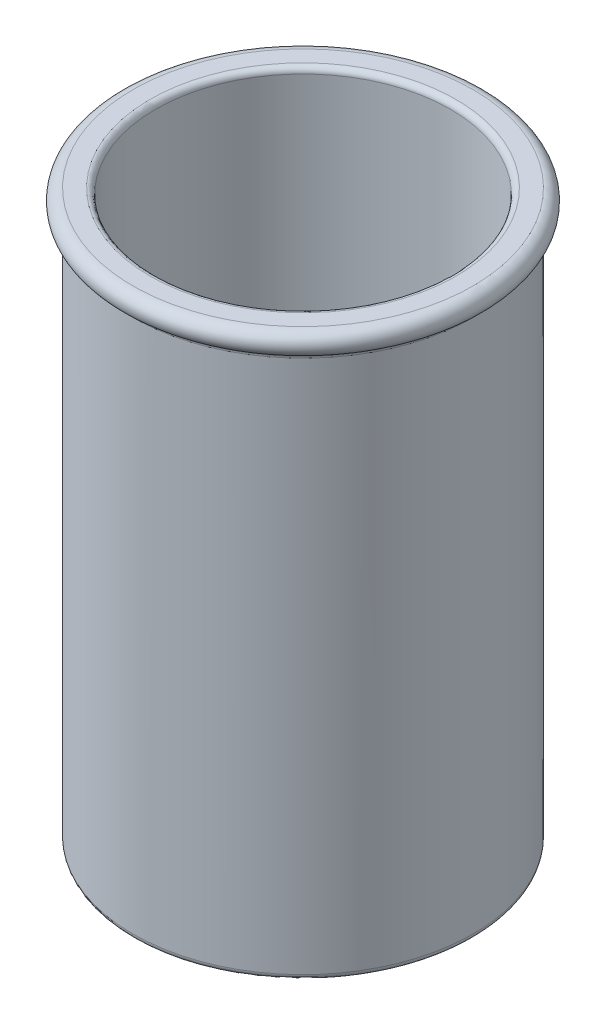
ISO-10303-21;
HEADER;
FILE_DESCRIPTION(('STEP AP214'),'2;1');
FILE_NAME('part.step','',(''),(''),'','','');
FILE_SCHEMA(('AUTOMOTIVE_DESIGN { 1 0 10303 214 1 1 1 1 }'));
ENDSEC;
DATA;
#1=APPLICATION_CONTEXT('core data for automotive mechanical design processes');
#2=APPLICATION_PROTOCOL_DEFINITION('international standard','automotive_design',2000,#1);
#3=PRODUCT_CONTEXT('',#1,'mechanical');
#4=PRODUCT('Part','Part','',(#3));
#5=PRODUCT_RELATED_PRODUCT_CATEGORY('part','',(#4));
#6=PRODUCT_DEFINITION_FORMATION('','',#4);
#7=PRODUCT_DEFINITION_CONTEXT('part definition',#1,'design');
#8=PRODUCT_DEFINITION('design','',#6,#7);
#9=PRODUCT_DEFINITION_SHAPE('','',#8);
#10=(LENGTH_UNIT() NAMED_UNIT(*) SI_UNIT(.MILLI.,.METRE.));
#11=(NAMED_UNIT(*) PLANE_ANGLE_UNIT() SI_UNIT($,.RADIAN.));
#12=(NAMED_UNIT(*) SI_UNIT($,.STERADIAN.) SOLID_ANGLE_UNIT());
#13=UNCERTAINTY_MEASURE_WITH_UNIT(LENGTH_MEASURE(1.E-05),#10,'distance_accuracy_value','');
#14=(GEOMETRIC_REPRESENTATION_CONTEXT(3) GLOBAL_UNCERTAINTY_ASSIGNED_CONTEXT((#13)) GLOBAL_UNIT_ASSIGNED_CONTEXT((#10,
#11,#12)) REPRESENTATION_CONTEXT('',''));
#15=CARTESIAN_POINT('',(0.,0.,0.));
#16=DIRECTION('',(0.,0.,1.));
#17=DIRECTION('',(1.,0.,0.));
#18=AXIS2_PLACEMENT_3D('',#15,#16,#17);
#19=CARTESIAN_POINT('',(0.,50.,0.));
#20=DIRECTION('',(0.,1.,0.));
#21=DIRECTION('',(0.,0.,1.));
#22=AXIS2_PLACEMENT_3D('',#19,#20,#21);
#23=PLANE('',#22);
#24=CARTESIAN_POINT('',(0.,50.,0.));
#25=DIRECTION('',(0.,1.,0.));
#26=DIRECTION('',(0.,0.,1.));
#27=AXIS2_PLACEMENT_3D('',#24,#25,#26);
#28=CIRCLE('',#27,13.5);
#29=CARTESIAN_POINT('',(0.,50.,13.5));
#30=VERTEX_POINT('',#29);
#31=EDGE_CURVE('E44',#30,#30,#28,.F.);
#32=ORIENTED_EDGE('',*,*,#31,.T.);
#33=EDGE_LOOP('',(#32));
#34=FACE_BOUND('',#33,.T.);
#35=CARTESIAN_POINT('',(0.,50.,0.));
#36=DIRECTION('',(0.,-1.,0.));
#37=DIRECTION('',(0.,0.,-1.));
#38=AXIS2_PLACEMENT_3D('',#35,#36,#37);
#39=CIRCLE('',#38,15.);
#40=CARTESIAN_POINT('',(0.,50.,-15.));
#41=VERTEX_POINT('',#40);
#42=EDGE_CURVE('E62',#41,#41,#39,.T.);
#43=ORIENTED_EDGE('',*,*,#42,.F.);
#44=EDGE_LOOP('',(#43));
#45=FACE_BOUND('',#44,.T.);
#46=ADVANCED_FACE('F33',(#34,#45),#23,.T.);
#47=CARTESIAN_POINT('',(0.,50.,0.));
#48=DIRECTION('',(0.,-1.,0.));
#49=DIRECTION('',(0.,0.,-1.));
#50=AXIS2_PLACEMENT_3D('',#47,#48,#49);
#51=CYLINDRICAL_SURFACE('',#50,13.);
#52=CARTESIAN_POINT('',(0.,49.5,0.));
#53=DIRECTION('',(0.,1.,0.));
#54=DIRECTION('',(0.,0.,1.));
#55=AXIS2_PLACEMENT_3D('',#52,#53,#54);
#56=CIRCLE('',#55,13.);
#57=CARTESIAN_POINT('',(0.,49.5,13.));
#58=VERTEX_POINT('',#57);
#59=EDGE_CURVE('E48',#58,#58,#56,.T.);
#60=ORIENTED_EDGE('',*,*,#59,.T.);
#61=EDGE_LOOP('',(#60));
#62=FACE_BOUND('',#61,.T.);
#63=CARTESIAN_POINT('',(0.,2.,0.));
#64=DIRECTION('',(0.,1.,0.));
#65=DIRECTION('',(0.,0.,1.));
#66=AXIS2_PLACEMENT_3D('',#63,#64,#65);
#67=CIRCLE('',#66,13.);
#68=CARTESIAN_POINT('',(0.,2.,13.));
#69=VERTEX_POINT('',#68);
#70=EDGE_CURVE('E59',#69,#69,#67,.F.);
#71=ORIENTED_EDGE('',*,*,#70,.T.);
#72=EDGE_LOOP('',(#71));
#73=FACE_BOUND('',#72,.T.);
#74=ADVANCED_FACE('F69',(#62,#73),#51,.F.);
#75=CARTESIAN_POINT('',(0.,2.,0.));
#76=DIRECTION('',(0.,1.,0.));
#77=DIRECTION('',(0.,0.,1.));
#78=AXIS2_PLACEMENT_3D('',#75,#76,#77);
#79=PLANE('',#78);
#80=ORIENTED_EDGE('',*,*,#70,.F.);
#81=EDGE_LOOP('',(#80));
#82=FACE_BOUND('',#81,.T.);
#83=ADVANCED_FACE('F76',(#82),#79,.T.);
#84=CARTESIAN_POINT('',(0.,49.,0.));
#85=DIRECTION('',(0.,-1.,0.));
#86=DIRECTION('',(0.,0.,-1.));
#87=AXIS2_PLACEMENT_3D('',#84,#85,#86);
#88=TOROIDAL_SURFACE('',#87,15.,1.);
#89=CARTESIAN_POINT('',(0.,48.0571909584182,0.));
#90=DIRECTION('',(0.,1.,0.));
#91=DIRECTION('',(0.,0.,1.));
#92=AXIS2_PLACEMENT_3D('',#89,#90,#91);
#93=CIRCLE('',#92,15.3333333333332);
#94=CARTESIAN_POINT('',(0.,48.0571909584182,15.3333333333332));
#95=VERTEX_POINT('',#94);
#96=EDGE_CURVE('E10',#95,#95,#93,.T.);
#97=ORIENTED_EDGE('',*,*,#96,.T.);
#98=EDGE_LOOP('',(#97));
#99=FACE_BOUND('',#98,.T.);
#100=ORIENTED_EDGE('',*,*,#42,.T.);
#101=EDGE_LOOP('',(#100));
#102=FACE_BOUND('',#101,.T.);
#103=ADVANCED_FACE('F66',(#99,#102),#88,.T.);
#104=CARTESIAN_POINT('',(0.,0.,0.));
#105=DIRECTION('',(0.,1.,0.));
#106=DIRECTION('',(0.,0.,1.));
#107=AXIS2_PLACEMENT_3D('',#104,#105,#106);
#108=PLANE('',#107);
#109=CARTESIAN_POINT('',(0.,0.,0.));
#110=DIRECTION('',(0.,1.,0.));
#111=DIRECTION('',(0.,0.,1.));
#112=AXIS2_PLACEMENT_3D('',#109,#110,#111);
#113=CIRCLE('',#112,14.5);
#114=CARTESIAN_POINT('',(0.,0.,14.5));
#115=VERTEX_POINT('',#114);
#116=EDGE_CURVE('E53',#115,#115,#113,.F.);
#117=ORIENTED_EDGE('',*,*,#116,.T.);
#118=EDGE_LOOP('',(#117));
#119=FACE_BOUND('',#118,.T.);
#120=ADVANCED_FACE('F84',(#119),#108,.F.);
#121=CARTESIAN_POINT('',(0.,2.,0.));
#122=DIRECTION('',(0.,-1.,0.));
#123=DIRECTION('',(0.,0.,-1.));
#124=AXIS2_PLACEMENT_3D('',#121,#122,#123);
#125=CYLINDRICAL_SURFACE('',#124,15.);
#126=CARTESIAN_POINT('',(0.,47.5857864376269,0.));
#127=DIRECTION('',(0.,-1.,0.));
#128=DIRECTION('',(0.,0.,-1.));
#129=AXIS2_PLACEMENT_3D('',#126,#127,#128);
#130=CIRCLE('',#129,15.);
#131=CARTESIAN_POINT('',(0.,47.5857864376269,-15.));
#132=VERTEX_POINT('',#131);
#133=EDGE_CURVE('E40',#132,#132,#130,.T.);
#134=ORIENTED_EDGE('',*,*,#133,.T.);
#135=EDGE_LOOP('',(#134));
#136=FACE_BOUND('',#135,.T.);
#137=CARTESIAN_POINT('',(0.,0.5,0.));
#138=DIRECTION('',(0.,1.,0.));
#139=DIRECTION('',(0.,0.,1.));
#140=AXIS2_PLACEMENT_3D('',#137,#138,#139);
#141=CIRCLE('',#140,15.);
#142=CARTESIAN_POINT('',(0.,0.5,15.));
#143=VERTEX_POINT('',#142);
#144=EDGE_CURVE('E56',#143,#143,#141,.T.);
#145=ORIENTED_EDGE('',*,*,#144,.T.);
#146=EDGE_LOOP('',(#145));
#147=FACE_BOUND('',#146,.T.);
#148=ADVANCED_FACE('F87',(#136,#147),#125,.T.);
#149=CARTESIAN_POINT('',(0.,0.5,0.));
#150=DIRECTION('',(0.,1.,0.));
#151=DIRECTION('',(0.,0.,1.));
#152=AXIS2_PLACEMENT_3D('',#149,#150,#151);
#153=TOROIDAL_SURFACE('',#152,14.5,0.5);
#154=ORIENTED_EDGE('',*,*,#116,.F.);
#155=EDGE_LOOP('',(#154));
#156=FACE_BOUND('',#155,.T.);
#157=ORIENTED_EDGE('',*,*,#144,.F.);
#158=EDGE_LOOP('',(#157));
#159=FACE_BOUND('',#158,.T.);
#160=ADVANCED_FACE('F91',(#156,#159),#153,.T.);
#161=CARTESIAN_POINT('',(0.,49.5,0.));
#162=DIRECTION('',(0.,1.,0.));
#163=DIRECTION('',(0.,0.,1.));
#164=AXIS2_PLACEMENT_3D('',#161,#162,#163);
#165=TOROIDAL_SURFACE('',#164,13.5,0.5);
#166=ORIENTED_EDGE('',*,*,#31,.F.);
#167=EDGE_LOOP('',(#166));
#168=FACE_BOUND('',#167,.T.);
#169=ORIENTED_EDGE('',*,*,#59,.F.);
#170=EDGE_LOOP('',(#169));
#171=FACE_BOUND('',#170,.T.);
#172=ADVANCED_FACE('F93',(#168,#171),#165,.T.);
#173=CARTESIAN_POINT('',(0.,47.5857864376269,0.));
#174=DIRECTION('',(0.,-1.,0.));
#175=DIRECTION('',(0.,0.,-1.));
#176=AXIS2_PLACEMENT_3D('',#173,#174,#175);
#177=TOROIDAL_SURFACE('',#176,15.5,0.5);
#178=ORIENTED_EDGE('',*,*,#96,.F.);
#179=EDGE_LOOP('',(#178));
#180=FACE_BOUND('',#179,.T.);
#181=ORIENTED_EDGE('',*,*,#133,.F.);
#182=EDGE_LOOP('',(#181));
#183=FACE_BOUND('',#182,.T.);
#184=ADVANCED_FACE('F35',(#180,#183),#177,.F.);
#185=CLOSED_SHELL('',(#46,#74,#83,#103,#120,#148,#160,#172,#184));
#186=MANIFOLD_SOLID_BREP('B2',#185);
#187=ADVANCED_BREP_SHAPE_REPRESENTATION('',(#18,#186),#14);
#188=SHAPE_DEFINITION_REPRESENTATION(#9,#187);
ENDSEC;
END-ISO-10303-21;
